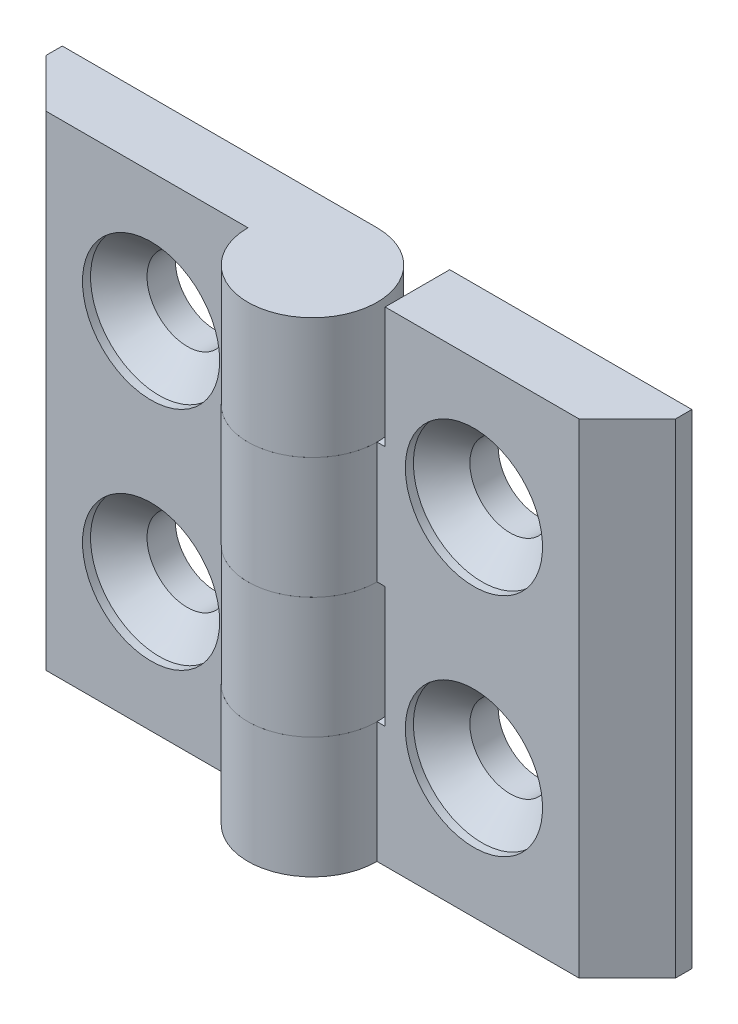
ISO-10303-21;
HEADER;
FILE_DESCRIPTION(('STEP AP214'),'2;1');
FILE_NAME('part.step','',(''),(''),'','','');
FILE_SCHEMA(('AUTOMOTIVE_DESIGN { 1 0 10303 214 1 1 1 1 }'));
ENDSEC;
DATA;
#1=APPLICATION_CONTEXT('core data for automotive mechanical design processes');
#2=APPLICATION_PROTOCOL_DEFINITION('international standard','automotive_design',2000,#1);
#3=PRODUCT_CONTEXT('',#1,'mechanical');
#4=PRODUCT('Part','Part','',(#3));
#5=PRODUCT_RELATED_PRODUCT_CATEGORY('part','',(#4));
#6=PRODUCT_DEFINITION_FORMATION('','',#4);
#7=PRODUCT_DEFINITION_CONTEXT('part definition',#1,'design');
#8=PRODUCT_DEFINITION('design','',#6,#7);
#9=PRODUCT_DEFINITION_SHAPE('','',#8);
#10=(LENGTH_UNIT() NAMED_UNIT(*) SI_UNIT(.MILLI.,.METRE.));
#11=(NAMED_UNIT(*) PLANE_ANGLE_UNIT() SI_UNIT($,.RADIAN.));
#12=(NAMED_UNIT(*) SI_UNIT($,.STERADIAN.) SOLID_ANGLE_UNIT());
#13=UNCERTAINTY_MEASURE_WITH_UNIT(LENGTH_MEASURE(1.E-05),#10,'distance_accuracy_value','');
#14=(GEOMETRIC_REPRESENTATION_CONTEXT(3) GLOBAL_UNCERTAINTY_ASSIGNED_CONTEXT((#13)) GLOBAL_UNIT_ASSIGNED_CONTEXT((#10,
#11,#12)) REPRESENTATION_CONTEXT('',''));
#15=CARTESIAN_POINT('',(0.,0.,0.));
#16=DIRECTION('',(0.,0.,1.));
#17=DIRECTION('',(1.,0.,0.));
#18=AXIS2_PLACEMENT_3D('',#15,#16,#17);
#19=CARTESIAN_POINT('',(0.,-15.,0.));
#20=DIRECTION('',(0.,1.,0.));
#21=DIRECTION('',(0.,0.,-1.));
#22=AXIS2_PLACEMENT_3D('',#19,#20,#21);
#23=CYLINDRICAL_SURFACE('',#22,4.);
#24=DIRECTION('',(0.,1.,0.));
#25=VECTOR('',#24,1.);
#26=CARTESIAN_POINT('',(4.,-15.,0.));
#27=LINE('',#26,#25);
#28=CARTESIAN_POINT('',(4.,-15.,0.));
#29=VERTEX_POINT('',#28);
#30=CARTESIAN_POINT('',(4.,-7.5,0.));
#31=VERTEX_POINT('',#30);
#32=EDGE_CURVE('E193',#29,#31,#27,.T.);
#33=ORIENTED_EDGE('',*,*,#32,.T.);
#34=CARTESIAN_POINT('',(0.,-7.5,0.));
#35=DIRECTION('',(0.,-1.,0.));
#36=DIRECTION('',(0.,0.,1.));
#37=AXIS2_PLACEMENT_3D('',#34,#35,#36);
#38=CIRCLE('',#37,4.);
#39=CARTESIAN_POINT('',(0.,-7.5,-4.));
#40=VERTEX_POINT('',#39);
#41=EDGE_CURVE('E170',#31,#40,#38,.T.);
#42=ORIENTED_EDGE('',*,*,#41,.T.);
#43=DIRECTION('',(0.,1.,0.));
#44=VECTOR('',#43,1.);
#45=CARTESIAN_POINT('',(0.,-15.,-4.));
#46=LINE('',#45,#44);
#47=CARTESIAN_POINT('',(0.,-15.,-4.));
#48=VERTEX_POINT('',#47);
#49=EDGE_CURVE('E206',#48,#40,#46,.T.);
#50=ORIENTED_EDGE('',*,*,#49,.F.);
#51=CARTESIAN_POINT('',(0.,-15.,0.));
#52=DIRECTION('',(0.,-1.,0.));
#53=DIRECTION('',(0.,0.,1.));
#54=AXIS2_PLACEMENT_3D('',#51,#52,#53);
#55=CIRCLE('',#54,4.);
#56=EDGE_CURVE('E173',#29,#48,#55,.T.);
#57=ORIENTED_EDGE('',*,*,#56,.F.);
#58=EDGE_LOOP('',(#33,#42,#50,#57));
#59=FACE_BOUND('',#58,.T.);
#60=ADVANCED_FACE('F44',(#59),#23,.T.);
#61=CARTESIAN_POINT('',(0.,0.,-4.));
#62=VERTEX_POINT('',#61);
#63=CARTESIAN_POINT('',(0.,7.5,-4.));
#64=VERTEX_POINT('',#63);
#65=EDGE_CURVE('E205',#62,#64,#46,.T.);
#66=ORIENTED_EDGE('',*,*,#65,.F.);
#67=CARTESIAN_POINT('',(0.,0.,0.));
#68=DIRECTION('',(0.,1.,0.));
#69=DIRECTION('',(0.,0.,-1.));
#70=AXIS2_PLACEMENT_3D('',#67,#68,#69);
#71=CIRCLE('',#70,4.);
#72=CARTESIAN_POINT('',(4.,0.,0.));
#73=VERTEX_POINT('',#72);
#74=EDGE_CURVE('E141',#62,#73,#71,.T.);
#75=ORIENTED_EDGE('',*,*,#74,.T.);
#76=CARTESIAN_POINT('',(4.,7.5,0.));
#77=VERTEX_POINT('',#76);
#78=EDGE_CURVE('E185',#73,#77,#27,.T.);
#79=ORIENTED_EDGE('',*,*,#78,.T.);
#80=CARTESIAN_POINT('',(0.,7.5,0.));
#81=DIRECTION('',(0.,-1.,0.));
#82=DIRECTION('',(1.,0.,0.));
#83=AXIS2_PLACEMENT_3D('',#80,#81,#82);
#84=CIRCLE('',#83,4.);
#85=EDGE_CURVE('E167',#77,#64,#84,.T.);
#86=ORIENTED_EDGE('',*,*,#85,.T.);
#87=EDGE_LOOP('',(#66,#75,#79,#86));
#88=FACE_BOUND('',#87,.T.);
#89=ADVANCED_FACE('F46',(#88),#23,.T.);
#90=CARTESIAN_POINT('',(0.,-15.,-4.));
#91=DIRECTION('',(0.,0.,1.));
#92=DIRECTION('',(-1.,0.,0.));
#93=AXIS2_PLACEMENT_3D('',#90,#91,#92);
#94=PLANE('',#93);
#95=CARTESIAN_POINT('',(9.99999999999997,-7.,-4.00000000000007));
#96=DIRECTION('',(0.,0.,1.));
#97=DIRECTION('',(-1.,0.,0.));
#98=AXIS2_PLACEMENT_3D('',#95,#96,#97);
#99=CIRCLE('',#98,2.5);
#100=CARTESIAN_POINT('',(7.49999999999997,-7.,-4.00000000000006));
#101=VERTEX_POINT('',#100);
#102=EDGE_CURVE('E376',#101,#101,#99,.T.);
#103=ORIENTED_EDGE('',*,*,#102,.T.);
#104=EDGE_LOOP('',(#103));
#105=FACE_BOUND('',#104,.T.);
#106=CARTESIAN_POINT('',(9.99999999999997,7.,-4.00000000000007));
#107=DIRECTION('',(0.,0.,1.));
#108=DIRECTION('',(-1.,0.,0.));
#109=AXIS2_PLACEMENT_3D('',#106,#107,#108);
#110=CIRCLE('',#109,2.5);
#111=CARTESIAN_POINT('',(7.49999999999997,7.,-4.00000000000006));
#112=VERTEX_POINT('',#111);
#113=EDGE_CURVE('E154',#112,#112,#110,.T.);
#114=ORIENTED_EDGE('',*,*,#113,.T.);
#115=EDGE_LOOP('',(#114));
#116=FACE_BOUND('',#115,.T.);
#117=ORIENTED_EDGE('',*,*,#49,.T.);
#118=DIRECTION('',(1.,0.,0.));
#119=VECTOR('',#118,1.);
#120=CARTESIAN_POINT('',(4.49999999999997,-7.5,-4.00000000000003));
#121=LINE('',#120,#119);
#122=CARTESIAN_POINT('',(4.49999999999997,-7.5,-4.00000000000003));
#123=VERTEX_POINT('',#122);
#124=EDGE_CURVE('E136',#40,#123,#121,.T.);
#125=ORIENTED_EDGE('',*,*,#124,.T.);
#126=DIRECTION('',(0.,1.,0.));
#127=VECTOR('',#126,1.);
#128=CARTESIAN_POINT('',(4.49999999999997,-7.5,-4.00000000000003));
#129=LINE('',#128,#127);
#130=CARTESIAN_POINT('',(4.49999999999997,0.,-4.00000000000003));
#131=VERTEX_POINT('',#130);
#132=EDGE_CURVE('E131',#123,#131,#129,.T.);
#133=ORIENTED_EDGE('',*,*,#132,.T.);
#134=DIRECTION('',(-1.,0.,0.));
#135=VECTOR('',#134,1.);
#136=CARTESIAN_POINT('',(4.49999999999997,0.,-4.00000000000003));
#137=LINE('',#136,#135);
#138=EDGE_CURVE('E139',#131,#62,#137,.T.);
#139=ORIENTED_EDGE('',*,*,#138,.T.);
#140=ORIENTED_EDGE('',*,*,#65,.T.);
#141=DIRECTION('',(1.,0.,0.));
#142=VECTOR('',#141,1.);
#143=CARTESIAN_POINT('',(-4.00000000000003,7.5,-3.99999999999997));
#144=LINE('',#143,#142);
#145=CARTESIAN_POINT('',(4.49999999999997,7.5,-4.00000000000003));
#146=VERTEX_POINT('',#145);
#147=EDGE_CURVE('E159',#64,#146,#144,.T.);
#148=ORIENTED_EDGE('',*,*,#147,.T.);
#149=DIRECTION('',(0.,1.,0.));
#150=VECTOR('',#149,1.);
#151=CARTESIAN_POINT('',(4.49999999999997,15.,-4.00000000000003));
#152=LINE('',#151,#150);
#153=CARTESIAN_POINT('',(4.49999999999997,15.,-4.00000000000003));
#154=VERTEX_POINT('',#153);
#155=EDGE_CURVE('E162',#146,#154,#152,.T.);
#156=ORIENTED_EDGE('',*,*,#155,.T.);
#157=DIRECTION('',(1.,0.,0.));
#158=VECTOR('',#157,1.);
#159=CARTESIAN_POINT('',(0.,15.,-4.));
#160=LINE('',#159,#158);
#161=CARTESIAN_POINT('',(19.5,15.,-4.00000000000014));
#162=VERTEX_POINT('',#161);
#163=EDGE_CURVE('E172',#154,#162,#160,.T.);
#164=ORIENTED_EDGE('',*,*,#163,.T.);
#165=DIRECTION('',(0.,1.,0.));
#166=VECTOR('',#165,1.);
#167=CARTESIAN_POINT('',(19.5,-15.,-4.00000000000014));
#168=LINE('',#167,#166);
#169=CARTESIAN_POINT('',(19.5,-15.,-4.00000000000014));
#170=VERTEX_POINT('',#169);
#171=EDGE_CURVE('E202',#170,#162,#168,.T.);
#172=ORIENTED_EDGE('',*,*,#171,.F.);
#173=DIRECTION('',(1.,0.,0.));
#174=VECTOR('',#173,1.);
#175=CARTESIAN_POINT('',(0.,-15.,-4.));
#176=LINE('',#175,#174);
#177=EDGE_CURVE('E176',#48,#170,#176,.T.);
#178=ORIENTED_EDGE('',*,*,#177,.F.);
#179=EDGE_LOOP('',(#117,#125,#133,#139,#140,#148,#156,#164,#172,#178));
#180=FACE_BOUND('',#179,.T.);
#181=ADVANCED_FACE('F147',(#105,#116,#180),#94,.F.);
#182=CARTESIAN_POINT('',(19.5,-15.,-4.00000000000014));
#183=DIRECTION('',(-1.,0.,0.));
#184=DIRECTION('',(0.,0.,-1.));
#185=AXIS2_PLACEMENT_3D('',#182,#183,#184);
#186=PLANE('',#185);
#187=DIRECTION('',(0.,0.,1.));
#188=VECTOR('',#187,1.);
#189=CARTESIAN_POINT('',(19.5,15.,-4.00000000000014));
#190=LINE('',#189,#188);
#191=CARTESIAN_POINT('',(19.5,15.,-3.00000000000014));
#192=VERTEX_POINT('',#191);
#193=EDGE_CURVE('E187',#162,#192,#190,.T.);
#194=ORIENTED_EDGE('',*,*,#193,.T.);
#195=DIRECTION('',(0.,1.,0.));
#196=VECTOR('',#195,1.);
#197=CARTESIAN_POINT('',(19.5,-15.,-3.00000000000014));
#198=LINE('',#197,#196);
#199=CARTESIAN_POINT('',(19.5,-15.,-3.00000000000014));
#200=VERTEX_POINT('',#199);
#201=EDGE_CURVE('E199',#200,#192,#198,.T.);
#202=ORIENTED_EDGE('',*,*,#201,.F.);
#203=DIRECTION('',(0.,0.,1.));
#204=VECTOR('',#203,1.);
#205=CARTESIAN_POINT('',(19.5,-15.,-4.00000000000014));
#206=LINE('',#205,#204);
#207=EDGE_CURVE('E179',#170,#200,#206,.T.);
#208=ORIENTED_EDGE('',*,*,#207,.F.);
#209=ORIENTED_EDGE('',*,*,#171,.T.);
#210=EDGE_LOOP('',(#194,#202,#208,#209));
#211=FACE_BOUND('',#210,.T.);
#212=ADVANCED_FACE('F236',(#211),#186,.F.);
#213=CARTESIAN_POINT('',(19.5,-15.,-3.00000000000014));
#214=DIRECTION('',(-0.707106781186549,0.,-0.707106781186546));
#215=DIRECTION('',(0.707106781186546,0.,-0.707106781186549));
#216=AXIS2_PLACEMENT_3D('',#213,#214,#215);
#217=PLANE('',#216);
#218=DIRECTION('',(-0.707106781186546,0.,0.707106781186549));
#219=VECTOR('',#218,1.);
#220=CARTESIAN_POINT('',(19.5,15.,-3.00000000000014));
#221=LINE('',#220,#219);
#222=CARTESIAN_POINT('',(16.5,15.,-1.23301553056196E-13));
#223=VERTEX_POINT('',#222);
#224=EDGE_CURVE('E189',#192,#223,#221,.T.);
#225=ORIENTED_EDGE('',*,*,#224,.T.);
#226=DIRECTION('',(0.,1.,0.));
#227=VECTOR('',#226,1.);
#228=CARTESIAN_POINT('',(16.5,-15.,-1.23301553056196E-13));
#229=LINE('',#228,#227);
#230=CARTESIAN_POINT('',(16.5,-15.,-1.23301553056196E-13));
#231=VERTEX_POINT('',#230);
#232=EDGE_CURVE('E196',#231,#223,#229,.T.);
#233=ORIENTED_EDGE('',*,*,#232,.F.);
#234=DIRECTION('',(-0.707106781186546,0.,0.707106781186549));
#235=VECTOR('',#234,1.);
#236=CARTESIAN_POINT('',(19.5,-15.,-3.00000000000014));
#237=LINE('',#236,#235);
#238=EDGE_CURVE('E181',#200,#231,#237,.T.);
#239=ORIENTED_EDGE('',*,*,#238,.F.);
#240=ORIENTED_EDGE('',*,*,#201,.T.);
#241=EDGE_LOOP('',(#225,#233,#239,#240));
#242=FACE_BOUND('',#241,.T.);
#243=ADVANCED_FACE('F233',(#242),#217,.F.);
#244=CARTESIAN_POINT('',(16.5,-15.,-1.23301553056196E-13));
#245=DIRECTION('',(0.,0.,-1.));
#246=DIRECTION('',(1.,0.,0.));
#247=AXIS2_PLACEMENT_3D('',#244,#245,#246);
#248=PLANE('',#247);
#249=CARTESIAN_POINT('',(10.,-7.,0.));
#250=DIRECTION('',(0.,0.,1.));
#251=DIRECTION('',(-1.,0.,0.));
#252=AXIS2_PLACEMENT_3D('',#249,#250,#251);
#253=CIRCLE('',#252,4.25);
#254=CARTESIAN_POINT('',(5.75,-7.,0.));
#255=VERTEX_POINT('',#254);
#256=EDGE_CURVE('E369',#255,#255,#253,.T.);
#257=ORIENTED_EDGE('',*,*,#256,.F.);
#258=EDGE_LOOP('',(#257));
#259=FACE_BOUND('',#258,.T.);
#260=CARTESIAN_POINT('',(10.,7.,0.));
#261=DIRECTION('',(0.,0.,1.));
#262=DIRECTION('',(-1.,0.,0.));
#263=AXIS2_PLACEMENT_3D('',#260,#261,#262);
#264=CIRCLE('',#263,4.25);
#265=CARTESIAN_POINT('',(5.75,7.,0.));
#266=VERTEX_POINT('',#265);
#267=EDGE_CURVE('E378',#266,#266,#264,.T.);
#268=ORIENTED_EDGE('',*,*,#267,.F.);
#269=EDGE_LOOP('',(#268));
#270=FACE_BOUND('',#269,.T.);
#271=DIRECTION('',(0.,-1.,0.));
#272=VECTOR('',#271,1.);
#273=CARTESIAN_POINT('',(4.5,-15.,0.));
#274=LINE('',#273,#272);
#275=CARTESIAN_POINT('',(4.5,0.,0.));
#276=VERTEX_POINT('',#275);
#277=CARTESIAN_POINT('',(4.5,-7.5,0.));
#278=VERTEX_POINT('',#277);
#279=EDGE_CURVE('E52',#276,#278,#274,.T.);
#280=ORIENTED_EDGE('',*,*,#279,.T.);
#281=DIRECTION('',(-1.,0.,0.));
#282=VECTOR('',#281,1.);
#283=CARTESIAN_POINT('',(16.5,-7.5,-1.23301553056196E-13));
#284=LINE('',#283,#282);
#285=EDGE_CURVE('E12',#278,#31,#284,.T.);
#286=ORIENTED_EDGE('',*,*,#285,.T.);
#287=ORIENTED_EDGE('',*,*,#32,.F.);
#288=DIRECTION('',(-1.,0.,0.));
#289=VECTOR('',#288,1.);
#290=CARTESIAN_POINT('',(16.5,-15.,-1.23301553056196E-13));
#291=LINE('',#290,#289);
#292=EDGE_CURVE('E183',#231,#29,#291,.T.);
#293=ORIENTED_EDGE('',*,*,#292,.F.);
#294=ORIENTED_EDGE('',*,*,#232,.T.);
#295=DIRECTION('',(-1.,0.,0.));
#296=VECTOR('',#295,1.);
#297=CARTESIAN_POINT('',(16.5,15.,-1.23301553056196E-13));
#298=LINE('',#297,#296);
#299=CARTESIAN_POINT('',(4.5,15.,0.));
#300=VERTEX_POINT('',#299);
#301=EDGE_CURVE('E177',#223,#300,#298,.T.);
#302=ORIENTED_EDGE('',*,*,#301,.T.);
#303=DIRECTION('',(0.,-1.,0.));
#304=VECTOR('',#303,1.);
#305=CARTESIAN_POINT('',(4.49999999999999,-15.,0.));
#306=LINE('',#305,#304);
#307=CARTESIAN_POINT('',(4.5,7.5,0.));
#308=VERTEX_POINT('',#307);
#309=EDGE_CURVE('E67',#300,#308,#306,.T.);
#310=ORIENTED_EDGE('',*,*,#309,.T.);
#311=DIRECTION('',(-1.,0.,0.));
#312=VECTOR('',#311,1.);
#313=CARTESIAN_POINT('',(16.5,7.5,-1.23301553056196E-13));
#314=LINE('',#313,#312);
#315=EDGE_CURVE('E208',#308,#77,#314,.T.);
#316=ORIENTED_EDGE('',*,*,#315,.T.);
#317=ORIENTED_EDGE('',*,*,#78,.F.);
#318=DIRECTION('',(1.,0.,0.));
#319=VECTOR('',#318,1.);
#320=CARTESIAN_POINT('',(16.5,0.,-1.23301553056196E-13));
#321=LINE('',#320,#319);
#322=EDGE_CURVE('E211',#73,#276,#321,.T.);
#323=ORIENTED_EDGE('',*,*,#322,.T.);
#324=EDGE_LOOP('',(#280,#286,#287,#293,#294,#302,#310,#316,#317,#323));
#325=FACE_BOUND('',#324,.T.);
#326=ADVANCED_FACE('F213',(#259,#270,#325),#248,.F.);
#327=CARTESIAN_POINT('',(0.,-15.,0.));
#328=DIRECTION('',(0.,-1.,0.));
#329=DIRECTION('',(0.,0.,1.));
#330=AXIS2_PLACEMENT_3D('',#327,#328,#329);
#331=PLANE('',#330);
#332=ORIENTED_EDGE('',*,*,#56,.T.);
#333=ORIENTED_EDGE('',*,*,#177,.T.);
#334=ORIENTED_EDGE('',*,*,#207,.T.);
#335=ORIENTED_EDGE('',*,*,#238,.T.);
#336=ORIENTED_EDGE('',*,*,#292,.T.);
#337=EDGE_LOOP('',(#332,#333,#334,#335,#336));
#338=FACE_BOUND('',#337,.T.);
#339=ADVANCED_FACE('F242',(#338),#331,.T.);
#340=CARTESIAN_POINT('',(0.,15.,0.));
#341=DIRECTION('',(0.,-1.,0.));
#342=DIRECTION('',(0.,0.,1.));
#343=AXIS2_PLACEMENT_3D('',#340,#341,#342);
#344=PLANE('',#343);
#345=ORIENTED_EDGE('',*,*,#163,.F.);
#346=DIRECTION('',(0.,0.,1.));
#347=VECTOR('',#346,1.);
#348=CARTESIAN_POINT('',(4.49999999999997,15.,-4.00000000000003));
#349=LINE('',#348,#347);
#350=EDGE_CURVE('E149',#154,#300,#349,.T.);
#351=ORIENTED_EDGE('',*,*,#350,.T.);
#352=ORIENTED_EDGE('',*,*,#301,.F.);
#353=ORIENTED_EDGE('',*,*,#224,.F.);
#354=ORIENTED_EDGE('',*,*,#193,.F.);
#355=EDGE_LOOP('',(#345,#351,#352,#353,#354));
#356=FACE_BOUND('',#355,.T.);
#357=ADVANCED_FACE('F226',(#356),#344,.F.);
#358=CARTESIAN_POINT('',(-4.00000000000003,7.5,-3.99999999999997));
#359=DIRECTION('',(0.,-1.,0.));
#360=DIRECTION('',(1.,0.,0.));
#361=AXIS2_PLACEMENT_3D('',#358,#359,#360);
#362=PLANE('',#361);
#363=ORIENTED_EDGE('',*,*,#85,.F.);
#364=ORIENTED_EDGE('',*,*,#315,.F.);
#365=DIRECTION('',(0.,0.,1.));
#366=VECTOR('',#365,1.);
#367=CARTESIAN_POINT('',(4.49999999999997,7.5,-4.00000000000003));
#368=LINE('',#367,#366);
#369=EDGE_CURVE('E151',#146,#308,#368,.T.);
#370=ORIENTED_EDGE('',*,*,#369,.F.);
#371=ORIENTED_EDGE('',*,*,#147,.F.);
#372=EDGE_LOOP('',(#363,#364,#370,#371));
#373=FACE_BOUND('',#372,.T.);
#374=ADVANCED_FACE('F222',(#373),#362,.F.);
#375=CARTESIAN_POINT('',(4.49999999999997,15.,-4.00000000000003));
#376=DIRECTION('',(1.,0.,0.));
#377=DIRECTION('',(0.,1.,0.));
#378=AXIS2_PLACEMENT_3D('',#375,#376,#377);
#379=PLANE('',#378);
#380=ORIENTED_EDGE('',*,*,#350,.F.);
#381=ORIENTED_EDGE('',*,*,#155,.F.);
#382=ORIENTED_EDGE('',*,*,#369,.T.);
#383=ORIENTED_EDGE('',*,*,#309,.F.);
#384=EDGE_LOOP('',(#380,#381,#382,#383));
#385=FACE_BOUND('',#384,.T.);
#386=ADVANCED_FACE('F223',(#385),#379,.F.);
#387=CARTESIAN_POINT('',(4.49999999999997,-7.5,-4.00000000000003));
#388=DIRECTION('',(1.,0.,0.));
#389=DIRECTION('',(0.,1.,0.));
#390=AXIS2_PLACEMENT_3D('',#387,#388,#389);
#391=PLANE('',#390);
#392=DIRECTION('',(0.,0.,1.));
#393=VECTOR('',#392,1.);
#394=CARTESIAN_POINT('',(4.49999999999997,0.,-4.00000000000003));
#395=LINE('',#394,#393);
#396=EDGE_CURVE('E59',#131,#276,#395,.T.);
#397=ORIENTED_EDGE('',*,*,#396,.F.);
#398=ORIENTED_EDGE('',*,*,#132,.F.);
#399=DIRECTION('',(0.,0.,1.));
#400=VECTOR('',#399,1.);
#401=CARTESIAN_POINT('',(4.49999999999997,-7.5,-4.00000000000003));
#402=LINE('',#401,#400);
#403=EDGE_CURVE('E135',#123,#278,#402,.T.);
#404=ORIENTED_EDGE('',*,*,#403,.T.);
#405=ORIENTED_EDGE('',*,*,#279,.F.);
#406=EDGE_LOOP('',(#397,#398,#404,#405));
#407=FACE_BOUND('',#406,.T.);
#408=ADVANCED_FACE('F128',(#407),#391,.F.);
#409=CARTESIAN_POINT('',(4.49999999999997,-7.5,-4.00000000000003));
#410=DIRECTION('',(0.,-1.,0.));
#411=DIRECTION('',(0.,0.,1.));
#412=AXIS2_PLACEMENT_3D('',#409,#410,#411);
#413=PLANE('',#412);
#414=ORIENTED_EDGE('',*,*,#41,.F.);
#415=ORIENTED_EDGE('',*,*,#285,.F.);
#416=ORIENTED_EDGE('',*,*,#403,.F.);
#417=ORIENTED_EDGE('',*,*,#124,.F.);
#418=EDGE_LOOP('',(#414,#415,#416,#417));
#419=FACE_BOUND('',#418,.T.);
#420=ADVANCED_FACE('F245',(#419),#413,.F.);
#421=CARTESIAN_POINT('',(4.49999999999997,0.,-4.00000000000003));
#422=DIRECTION('',(0.,1.,0.));
#423=DIRECTION('',(0.,0.,-1.));
#424=AXIS2_PLACEMENT_3D('',#421,#422,#423);
#425=PLANE('',#424);
#426=ORIENTED_EDGE('',*,*,#138,.F.);
#427=ORIENTED_EDGE('',*,*,#396,.T.);
#428=ORIENTED_EDGE('',*,*,#322,.F.);
#429=ORIENTED_EDGE('',*,*,#74,.F.);
#430=EDGE_LOOP('',(#426,#427,#428,#429));
#431=FACE_BOUND('',#430,.T.);
#432=ADVANCED_FACE('F140',(#431),#425,.F.);
#433=CARTESIAN_POINT('',(10.,7.,0.));
#434=DIRECTION('',(0.,0.,1.));
#435=DIRECTION('',(-1.,0.,0.));
#436=AXIS2_PLACEMENT_3D('',#433,#434,#435);
#437=CYLINDRICAL_SURFACE('',#436,2.5);
#438=ORIENTED_EDGE('',*,*,#113,.F.);
#439=EDGE_LOOP('',(#438));
#440=FACE_BOUND('',#439,.T.);
#441=CARTESIAN_POINT('',(9.99999999999998,7.,-2.25000000000007));
#442=DIRECTION('',(0.,0.,1.));
#443=DIRECTION('',(-1.,0.,0.));
#444=AXIS2_PLACEMENT_3D('',#441,#442,#443);
#445=CIRCLE('',#444,2.5);
#446=CARTESIAN_POINT('',(7.49999999999998,7.,-2.25000000000005));
#447=VERTEX_POINT('',#446);
#448=EDGE_CURVE('E383',#447,#447,#445,.T.);
#449=ORIENTED_EDGE('',*,*,#448,.T.);
#450=EDGE_LOOP('',(#449));
#451=FACE_BOUND('',#450,.T.);
#452=ADVANCED_FACE('F252',(#440,#451),#437,.F.);
#453=CARTESIAN_POINT('',(9.99999999999999,7.,-0.500000000000075));
#454=DIRECTION('',(0.,0.,1.));
#455=DIRECTION('',(-1.,0.,0.));
#456=AXIS2_PLACEMENT_3D('',#453,#454,#455);
#457=CONICAL_SURFACE('',#456,4.25,0.785398163397449);
#458=ORIENTED_EDGE('',*,*,#448,.F.);
#459=EDGE_LOOP('',(#458));
#460=FACE_BOUND('',#459,.T.);
#461=CARTESIAN_POINT('',(9.99999999999999,7.,-0.500000000000075));
#462=DIRECTION('',(0.,0.,1.));
#463=DIRECTION('',(-1.,0.,0.));
#464=AXIS2_PLACEMENT_3D('',#461,#462,#463);
#465=CIRCLE('',#464,4.25);
#466=CARTESIAN_POINT('',(5.74999999999999,7.,-0.500000000000043));
#467=VERTEX_POINT('',#466);
#468=EDGE_CURVE('E381',#467,#467,#465,.T.);
#469=ORIENTED_EDGE('',*,*,#468,.T.);
#470=EDGE_LOOP('',(#469));
#471=FACE_BOUND('',#470,.T.);
#472=ADVANCED_FACE('F310',(#460,#471),#457,.F.);
#473=CARTESIAN_POINT('',(10.,7.,0.));
#474=DIRECTION('',(0.,0.,1.));
#475=DIRECTION('',(-1.,0.,0.));
#476=AXIS2_PLACEMENT_3D('',#473,#474,#475);
#477=CYLINDRICAL_SURFACE('',#476,4.25);
#478=ORIENTED_EDGE('',*,*,#468,.F.);
#479=EDGE_LOOP('',(#478));
#480=FACE_BOUND('',#479,.T.);
#481=ORIENTED_EDGE('',*,*,#267,.T.);
#482=EDGE_LOOP('',(#481));
#483=FACE_BOUND('',#482,.T.);
#484=ADVANCED_FACE('F319',(#480,#483),#477,.F.);
#485=CARTESIAN_POINT('',(10.,-7.,0.));
#486=DIRECTION('',(0.,0.,1.));
#487=DIRECTION('',(-1.,0.,0.));
#488=AXIS2_PLACEMENT_3D('',#485,#486,#487);
#489=CYLINDRICAL_SURFACE('',#488,2.5);
#490=ORIENTED_EDGE('',*,*,#102,.F.);
#491=EDGE_LOOP('',(#490));
#492=FACE_BOUND('',#491,.T.);
#493=CARTESIAN_POINT('',(9.99999999999998,-7.,-2.25000000000007));
#494=DIRECTION('',(0.,0.,1.));
#495=DIRECTION('',(-1.,0.,0.));
#496=AXIS2_PLACEMENT_3D('',#493,#494,#495);
#497=CIRCLE('',#496,2.5);
#498=CARTESIAN_POINT('',(7.49999999999998,-7.,-2.25000000000005));
#499=VERTEX_POINT('',#498);
#500=EDGE_CURVE('E371',#499,#499,#497,.T.);
#501=ORIENTED_EDGE('',*,*,#500,.T.);
#502=EDGE_LOOP('',(#501));
#503=FACE_BOUND('',#502,.T.);
#504=ADVANCED_FACE('F329',(#492,#503),#489,.F.);
#505=CARTESIAN_POINT('',(9.99999999999999,-7.,-0.500000000000075));
#506=DIRECTION('',(0.,0.,1.));
#507=DIRECTION('',(-1.,0.,0.));
#508=AXIS2_PLACEMENT_3D('',#505,#506,#507);
#509=CONICAL_SURFACE('',#508,4.25,0.785398163397449);
#510=ORIENTED_EDGE('',*,*,#500,.F.);
#511=EDGE_LOOP('',(#510));
#512=FACE_BOUND('',#511,.T.);
#513=CARTESIAN_POINT('',(9.99999999999999,-7.,-0.500000000000075));
#514=DIRECTION('',(0.,0.,1.));
#515=DIRECTION('',(-1.,0.,0.));
#516=AXIS2_PLACEMENT_3D('',#513,#514,#515);
#517=CIRCLE('',#516,4.25);
#518=CARTESIAN_POINT('',(5.74999999999999,-7.,-0.500000000000043));
#519=VERTEX_POINT('',#518);
#520=EDGE_CURVE('E366',#519,#519,#517,.T.);
#521=ORIENTED_EDGE('',*,*,#520,.T.);
#522=EDGE_LOOP('',(#521));
#523=FACE_BOUND('',#522,.T.);
#524=ADVANCED_FACE('F339',(#512,#523),#509,.F.);
#525=CARTESIAN_POINT('',(10.,-7.,0.));
#526=DIRECTION('',(0.,0.,1.));
#527=DIRECTION('',(-1.,0.,0.));
#528=AXIS2_PLACEMENT_3D('',#525,#526,#527);
#529=CYLINDRICAL_SURFACE('',#528,4.25);
#530=ORIENTED_EDGE('',*,*,#520,.F.);
#531=EDGE_LOOP('',(#530));
#532=FACE_BOUND('',#531,.T.);
#533=ORIENTED_EDGE('',*,*,#256,.T.);
#534=EDGE_LOOP('',(#533));
#535=FACE_BOUND('',#534,.T.);
#536=ADVANCED_FACE('F349',(#532,#535),#529,.F.);
#537=CLOSED_SHELL('',(#60,#89,#181,#212,#243,#326,#339,#357,#374,#386,#408,#420,#432,#452,#472,
#484,#504,#524,#536));
#538=MANIFOLD_SOLID_BREP('B2',#537);
#539=CARTESIAN_POINT('',(0.,15.,0.));
#540=DIRECTION('',(0.,-1.,0.));
#541=DIRECTION('',(0.,0.,-1.));
#542=AXIS2_PLACEMENT_3D('',#539,#540,#541);
#543=CYLINDRICAL_SURFACE('',#542,4.);
#544=DIRECTION('',(0.,-1.,0.));
#545=VECTOR('',#544,1.);
#546=CARTESIAN_POINT('',(-4.,15.,0.));
#547=LINE('',#546,#545);
#548=CARTESIAN_POINT('',(-4.,15.,0.));
#549=VERTEX_POINT('',#548);
#550=CARTESIAN_POINT('',(-4.,7.5,0.));
#551=VERTEX_POINT('',#550);
#552=EDGE_CURVE('E597',#549,#551,#547,.T.);
#553=ORIENTED_EDGE('',*,*,#552,.T.);
#554=CARTESIAN_POINT('',(0.,7.5,0.));
#555=DIRECTION('',(0.,1.,0.));
#556=DIRECTION('',(0.,0.,1.));
#557=AXIS2_PLACEMENT_3D('',#554,#555,#556);
#558=CIRCLE('',#557,4.);
#559=CARTESIAN_POINT('',(0.,7.5,-4.));
#560=VERTEX_POINT('',#559);
#561=EDGE_CURVE('E574',#551,#560,#558,.T.);
#562=ORIENTED_EDGE('',*,*,#561,.T.);
#563=DIRECTION('',(0.,-1.,0.));
#564=VECTOR('',#563,1.);
#565=CARTESIAN_POINT('',(0.,15.,-4.));
#566=LINE('',#565,#564);
#567=CARTESIAN_POINT('',(0.,15.,-4.));
#568=VERTEX_POINT('',#567);
#569=EDGE_CURVE('E610',#568,#560,#566,.T.);
#570=ORIENTED_EDGE('',*,*,#569,.F.);
#571=CARTESIAN_POINT('',(0.,15.,0.));
#572=DIRECTION('',(0.,1.,0.));
#573=DIRECTION('',(0.,0.,1.));
#574=AXIS2_PLACEMENT_3D('',#571,#572,#573);
#575=CIRCLE('',#574,4.);
#576=EDGE_CURVE('E577',#549,#568,#575,.T.);
#577=ORIENTED_EDGE('',*,*,#576,.F.);
#578=EDGE_LOOP('',(#553,#562,#570,#577));
#579=FACE_BOUND('',#578,.T.);
#580=ADVANCED_FACE('F448',(#579),#543,.T.);
#581=CARTESIAN_POINT('',(0.,0.,-4.));
#582=VERTEX_POINT('',#581);
#583=CARTESIAN_POINT('',(0.,-7.5,-4.));
#584=VERTEX_POINT('',#583);
#585=EDGE_CURVE('E609',#582,#584,#566,.T.);
#586=ORIENTED_EDGE('',*,*,#585,.F.);
#587=CARTESIAN_POINT('',(0.,0.,0.));
#588=DIRECTION('',(0.,-1.,0.));
#589=DIRECTION('',(0.,0.,-1.));
#590=AXIS2_PLACEMENT_3D('',#587,#588,#589);
#591=CIRCLE('',#590,4.);
#592=CARTESIAN_POINT('',(-4.,0.,0.));
#593=VERTEX_POINT('',#592);
#594=EDGE_CURVE('E545',#582,#593,#591,.T.);
#595=ORIENTED_EDGE('',*,*,#594,.T.);
#596=CARTESIAN_POINT('',(-4.,-7.5,0.));
#597=VERTEX_POINT('',#596);
#598=EDGE_CURVE('E589',#593,#597,#547,.T.);
#599=ORIENTED_EDGE('',*,*,#598,.T.);
#600=CARTESIAN_POINT('',(0.,-7.5,0.));
#601=DIRECTION('',(0.,1.,0.));
#602=DIRECTION('',(-1.,0.,0.));
#603=AXIS2_PLACEMENT_3D('',#600,#601,#602);
#604=CIRCLE('',#603,4.);
#605=EDGE_CURVE('E571',#597,#584,#604,.T.);
#606=ORIENTED_EDGE('',*,*,#605,.T.);
#607=EDGE_LOOP('',(#586,#595,#599,#606));
#608=FACE_BOUND('',#607,.T.);
#609=ADVANCED_FACE('F450',(#608),#543,.T.);
#610=CARTESIAN_POINT('',(0.,15.,-4.));
#611=DIRECTION('',(0.,0.,1.));
#612=DIRECTION('',(1.,0.,0.));
#613=AXIS2_PLACEMENT_3D('',#610,#611,#612);
#614=PLANE('',#613);
#615=CARTESIAN_POINT('',(-10.,7.,-4.));
#616=DIRECTION('',(0.,0.,1.));
#617=DIRECTION('',(1.,0.,0.));
#618=AXIS2_PLACEMENT_3D('',#615,#616,#617);
#619=CIRCLE('',#618,2.5);
#620=CARTESIAN_POINT('',(-7.5,7.,-4.));
#621=VERTEX_POINT('',#620);
#622=EDGE_CURVE('E794',#621,#621,#619,.T.);
#623=ORIENTED_EDGE('',*,*,#622,.T.);
#624=EDGE_LOOP('',(#623));
#625=FACE_BOUND('',#624,.T.);
#626=CARTESIAN_POINT('',(-10.,-7.,-4.));
#627=DIRECTION('',(0.,0.,1.));
#628=DIRECTION('',(1.,0.,0.));
#629=AXIS2_PLACEMENT_3D('',#626,#627,#628);
#630=CIRCLE('',#629,2.5);
#631=CARTESIAN_POINT('',(-7.5,-7.,-4.));
#632=VERTEX_POINT('',#631);
#633=EDGE_CURVE('E558',#632,#632,#630,.T.);
#634=ORIENTED_EDGE('',*,*,#633,.T.);
#635=EDGE_LOOP('',(#634));
#636=FACE_BOUND('',#635,.T.);
#637=ORIENTED_EDGE('',*,*,#569,.T.);
#638=DIRECTION('',(-1.,0.,0.));
#639=VECTOR('',#638,1.);
#640=CARTESIAN_POINT('',(-4.5,7.5,-4.));
#641=LINE('',#640,#639);
#642=CARTESIAN_POINT('',(-4.5,7.5,-4.));
#643=VERTEX_POINT('',#642);
#644=EDGE_CURVE('E540',#560,#643,#641,.T.);
#645=ORIENTED_EDGE('',*,*,#644,.T.);
#646=DIRECTION('',(0.,-1.,0.));
#647=VECTOR('',#646,1.);
#648=CARTESIAN_POINT('',(-4.5,7.5,-4.));
#649=LINE('',#648,#647);
#650=CARTESIAN_POINT('',(-4.5,0.,-4.));
#651=VERTEX_POINT('',#650);
#652=EDGE_CURVE('E535',#643,#651,#649,.T.);
#653=ORIENTED_EDGE('',*,*,#652,.T.);
#654=DIRECTION('',(1.,0.,0.));
#655=VECTOR('',#654,1.);
#656=CARTESIAN_POINT('',(-4.5,0.,-4.));
#657=LINE('',#656,#655);
#658=EDGE_CURVE('E543',#651,#582,#657,.T.);
#659=ORIENTED_EDGE('',*,*,#658,.T.);
#660=ORIENTED_EDGE('',*,*,#585,.T.);
#661=DIRECTION('',(-1.,0.,0.));
#662=VECTOR('',#661,1.);
#663=CARTESIAN_POINT('',(4.,-7.5,-4.));
#664=LINE('',#663,#662);
#665=CARTESIAN_POINT('',(-4.5,-7.5,-4.));
#666=VERTEX_POINT('',#665);
#667=EDGE_CURVE('E563',#584,#666,#664,.T.);
#668=ORIENTED_EDGE('',*,*,#667,.T.);
#669=DIRECTION('',(0.,-1.,0.));
#670=VECTOR('',#669,1.);
#671=CARTESIAN_POINT('',(-4.5,-15.,-4.));
#672=LINE('',#671,#670);
#673=CARTESIAN_POINT('',(-4.5,-15.,-4.));
#674=VERTEX_POINT('',#673);
#675=EDGE_CURVE('E566',#666,#674,#672,.T.);
#676=ORIENTED_EDGE('',*,*,#675,.T.);
#677=DIRECTION('',(-1.,0.,0.));
#678=VECTOR('',#677,1.);
#679=CARTESIAN_POINT('',(0.,-15.,-4.));
#680=LINE('',#679,#678);
#681=CARTESIAN_POINT('',(-19.5,-15.,-4.));
#682=VERTEX_POINT('',#681);
#683=EDGE_CURVE('E576',#674,#682,#680,.T.);
#684=ORIENTED_EDGE('',*,*,#683,.T.);
#685=DIRECTION('',(0.,-1.,0.));
#686=VECTOR('',#685,1.);
#687=CARTESIAN_POINT('',(-19.5,15.,-4.));
#688=LINE('',#687,#686);
#689=CARTESIAN_POINT('',(-19.5,15.,-4.));
#690=VERTEX_POINT('',#689);
#691=EDGE_CURVE('E606',#690,#682,#688,.T.);
#692=ORIENTED_EDGE('',*,*,#691,.F.);
#693=DIRECTION('',(-1.,0.,0.));
#694=VECTOR('',#693,1.);
#695=CARTESIAN_POINT('',(0.,15.,-4.));
#696=LINE('',#695,#694);
#697=EDGE_CURVE('E580',#568,#690,#696,.T.);
#698=ORIENTED_EDGE('',*,*,#697,.F.);
#699=EDGE_LOOP('',(#637,#645,#653,#659,#660,#668,#676,#684,#692,#698));
#700=FACE_BOUND('',#699,.T.);
#701=ADVANCED_FACE('F551',(#625,#636,#700),#614,.F.);
#702=CARTESIAN_POINT('',(-19.5,15.,-4.));
#703=DIRECTION('',(1.,0.,0.));
#704=DIRECTION('',(0.,0.,-1.));
#705=AXIS2_PLACEMENT_3D('',#702,#703,#704);
#706=PLANE('',#705);
#707=DIRECTION('',(0.,0.,1.));
#708=VECTOR('',#707,1.);
#709=CARTESIAN_POINT('',(-19.5,-15.,-4.));
#710=LINE('',#709,#708);
#711=CARTESIAN_POINT('',(-19.5,-15.,-3.));
#712=VERTEX_POINT('',#711);
#713=EDGE_CURVE('E591',#682,#712,#710,.T.);
#714=ORIENTED_EDGE('',*,*,#713,.T.);
#715=DIRECTION('',(0.,-1.,0.));
#716=VECTOR('',#715,1.);
#717=CARTESIAN_POINT('',(-19.5,15.,-3.));
#718=LINE('',#717,#716);
#719=CARTESIAN_POINT('',(-19.5,15.,-3.));
#720=VERTEX_POINT('',#719);
#721=EDGE_CURVE('E603',#720,#712,#718,.T.);
#722=ORIENTED_EDGE('',*,*,#721,.F.);
#723=DIRECTION('',(0.,0.,1.));
#724=VECTOR('',#723,1.);
#725=CARTESIAN_POINT('',(-19.5,15.,-4.));
#726=LINE('',#725,#724);
#727=EDGE_CURVE('E583',#690,#720,#726,.T.);
#728=ORIENTED_EDGE('',*,*,#727,.F.);
#729=ORIENTED_EDGE('',*,*,#691,.T.);
#730=EDGE_LOOP('',(#714,#722,#728,#729));
#731=FACE_BOUND('',#730,.T.);
#732=ADVANCED_FACE('F640',(#731),#706,.F.);
#733=CARTESIAN_POINT('',(-19.5,15.,-3.));
#734=DIRECTION('',(0.707106781186544,0.,-0.707106781186551));
#735=DIRECTION('',(-0.707106781186551,0.,-0.707106781186544));
#736=AXIS2_PLACEMENT_3D('',#733,#734,#735);
#737=PLANE('',#736);
#738=DIRECTION('',(0.707106781186551,0.,0.707106781186544));
#739=VECTOR('',#738,1.);
#740=CARTESIAN_POINT('',(-19.5,-15.,-3.));
#741=LINE('',#740,#739);
#742=CARTESIAN_POINT('',(-16.5,-15.,0.));
#743=VERTEX_POINT('',#742);
#744=EDGE_CURVE('E593',#712,#743,#741,.T.);
#745=ORIENTED_EDGE('',*,*,#744,.T.);
#746=DIRECTION('',(0.,-1.,0.));
#747=VECTOR('',#746,1.);
#748=CARTESIAN_POINT('',(-16.5,15.,0.));
#749=LINE('',#748,#747);
#750=CARTESIAN_POINT('',(-16.5,15.,0.));
#751=VERTEX_POINT('',#750);
#752=EDGE_CURVE('E600',#751,#743,#749,.T.);
#753=ORIENTED_EDGE('',*,*,#752,.F.);
#754=DIRECTION('',(0.707106781186551,0.,0.707106781186544));
#755=VECTOR('',#754,1.);
#756=CARTESIAN_POINT('',(-19.5,15.,-3.));
#757=LINE('',#756,#755);
#758=EDGE_CURVE('E585',#720,#751,#757,.T.);
#759=ORIENTED_EDGE('',*,*,#758,.F.);
#760=ORIENTED_EDGE('',*,*,#721,.T.);
#761=EDGE_LOOP('',(#745,#753,#759,#760));
#762=FACE_BOUND('',#761,.T.);
#763=ADVANCED_FACE('F637',(#762),#737,.F.);
#764=CARTESIAN_POINT('',(-16.5,15.,0.));
#765=DIRECTION('',(0.,0.,-1.));
#766=DIRECTION('',(-1.,0.,0.));
#767=AXIS2_PLACEMENT_3D('',#764,#765,#766);
#768=PLANE('',#767);
#769=CARTESIAN_POINT('',(-10.,7.,0.));
#770=DIRECTION('',(0.,0.,1.));
#771=DIRECTION('',(1.,0.,0.));
#772=AXIS2_PLACEMENT_3D('',#769,#770,#771);
#773=CIRCLE('',#772,4.25);
#774=CARTESIAN_POINT('',(-5.75,7.,0.));
#775=VERTEX_POINT('',#774);
#776=EDGE_CURVE('E787',#775,#775,#773,.T.);
#777=ORIENTED_EDGE('',*,*,#776,.F.);
#778=EDGE_LOOP('',(#777));
#779=FACE_BOUND('',#778,.T.);
#780=CARTESIAN_POINT('',(-10.,-7.,0.));
#781=DIRECTION('',(0.,0.,1.));
#782=DIRECTION('',(1.,0.,0.));
#783=AXIS2_PLACEMENT_3D('',#780,#781,#782);
#784=CIRCLE('',#783,4.25);
#785=CARTESIAN_POINT('',(-5.75,-7.,0.));
#786=VERTEX_POINT('',#785);
#787=EDGE_CURVE('E796',#786,#786,#784,.T.);
#788=ORIENTED_EDGE('',*,*,#787,.F.);
#789=EDGE_LOOP('',(#788));
#790=FACE_BOUND('',#789,.T.);
#791=DIRECTION('',(0.,1.,0.));
#792=VECTOR('',#791,1.);
#793=CARTESIAN_POINT('',(-4.5,15.,0.));
#794=LINE('',#793,#792);
#795=CARTESIAN_POINT('',(-4.5,0.,0.));
#796=VERTEX_POINT('',#795);
#797=CARTESIAN_POINT('',(-4.5,7.5,0.));
#798=VERTEX_POINT('',#797);
#799=EDGE_CURVE('E456',#796,#798,#794,.T.);
#800=ORIENTED_EDGE('',*,*,#799,.T.);
#801=DIRECTION('',(1.,0.,0.));
#802=VECTOR('',#801,1.);
#803=CARTESIAN_POINT('',(-16.5,7.5,0.));
#804=LINE('',#803,#802);
#805=EDGE_CURVE('E42',#798,#551,#804,.T.);
#806=ORIENTED_EDGE('',*,*,#805,.T.);
#807=ORIENTED_EDGE('',*,*,#552,.F.);
#808=DIRECTION('',(1.,0.,0.));
#809=VECTOR('',#808,1.);
#810=CARTESIAN_POINT('',(-16.5,15.,0.));
#811=LINE('',#810,#809);
#812=EDGE_CURVE('E587',#751,#549,#811,.T.);
#813=ORIENTED_EDGE('',*,*,#812,.F.);
#814=ORIENTED_EDGE('',*,*,#752,.T.);
#815=DIRECTION('',(1.,0.,0.));
#816=VECTOR('',#815,1.);
#817=CARTESIAN_POINT('',(-16.5,-15.,0.));
#818=LINE('',#817,#816);
#819=CARTESIAN_POINT('',(-4.5,-15.,0.));
#820=VERTEX_POINT('',#819);
#821=EDGE_CURVE('E581',#743,#820,#818,.T.);
#822=ORIENTED_EDGE('',*,*,#821,.T.);
#823=DIRECTION('',(0.,1.,0.));
#824=VECTOR('',#823,1.);
#825=CARTESIAN_POINT('',(-4.49999999999999,15.,0.));
#826=LINE('',#825,#824);
#827=CARTESIAN_POINT('',(-4.5,-7.5,0.));
#828=VERTEX_POINT('',#827);
#829=EDGE_CURVE('E471',#820,#828,#826,.T.);
#830=ORIENTED_EDGE('',*,*,#829,.T.);
#831=DIRECTION('',(1.,0.,0.));
#832=VECTOR('',#831,1.);
#833=CARTESIAN_POINT('',(-16.5,-7.5,0.));
#834=LINE('',#833,#832);
#835=EDGE_CURVE('E612',#828,#597,#834,.T.);
#836=ORIENTED_EDGE('',*,*,#835,.T.);
#837=ORIENTED_EDGE('',*,*,#598,.F.);
#838=DIRECTION('',(-1.,0.,0.));
#839=VECTOR('',#838,1.);
#840=CARTESIAN_POINT('',(-16.5,0.,0.));
#841=LINE('',#840,#839);
#842=EDGE_CURVE('E615',#593,#796,#841,.T.);
#843=ORIENTED_EDGE('',*,*,#842,.T.);
#844=EDGE_LOOP('',(#800,#806,#807,#813,#814,#822,#830,#836,#837,#843));
#845=FACE_BOUND('',#844,.T.);
#846=ADVANCED_FACE('F617',(#779,#790,#845),#768,.F.);
#847=CARTESIAN_POINT('',(0.,15.,0.));
#848=DIRECTION('',(0.,1.,0.));
#849=DIRECTION('',(0.,0.,1.));
#850=AXIS2_PLACEMENT_3D('',#847,#848,#849);
#851=PLANE('',#850);
#852=ORIENTED_EDGE('',*,*,#576,.T.);
#853=ORIENTED_EDGE('',*,*,#697,.T.);
#854=ORIENTED_EDGE('',*,*,#727,.T.);
#855=ORIENTED_EDGE('',*,*,#758,.T.);
#856=ORIENTED_EDGE('',*,*,#812,.T.);
#857=EDGE_LOOP('',(#852,#853,#854,#855,#856));
#858=FACE_BOUND('',#857,.T.);
#859=ADVANCED_FACE('F646',(#858),#851,.T.);
#860=CARTESIAN_POINT('',(0.,-15.,0.));
#861=DIRECTION('',(0.,1.,0.));
#862=DIRECTION('',(0.,0.,1.));
#863=AXIS2_PLACEMENT_3D('',#860,#861,#862);
#864=PLANE('',#863);
#865=ORIENTED_EDGE('',*,*,#683,.F.);
#866=DIRECTION('',(0.,0.,1.));
#867=VECTOR('',#866,1.);
#868=CARTESIAN_POINT('',(-4.5,-15.,-4.));
#869=LINE('',#868,#867);
#870=EDGE_CURVE('E553',#674,#820,#869,.T.);
#871=ORIENTED_EDGE('',*,*,#870,.T.);
#872=ORIENTED_EDGE('',*,*,#821,.F.);
#873=ORIENTED_EDGE('',*,*,#744,.F.);
#874=ORIENTED_EDGE('',*,*,#713,.F.);
#875=EDGE_LOOP('',(#865,#871,#872,#873,#874));
#876=FACE_BOUND('',#875,.T.);
#877=ADVANCED_FACE('F630',(#876),#864,.F.);
#878=CARTESIAN_POINT('',(4.,-7.5,-4.));
#879=DIRECTION('',(0.,1.,0.));
#880=DIRECTION('',(-1.,0.,0.));
#881=AXIS2_PLACEMENT_3D('',#878,#879,#880);
#882=PLANE('',#881);
#883=ORIENTED_EDGE('',*,*,#605,.F.);
#884=ORIENTED_EDGE('',*,*,#835,.F.);
#885=DIRECTION('',(0.,0.,1.));
#886=VECTOR('',#885,1.);
#887=CARTESIAN_POINT('',(-4.5,-7.5,-4.));
#888=LINE('',#887,#886);
#889=EDGE_CURVE('E555',#666,#828,#888,.T.);
#890=ORIENTED_EDGE('',*,*,#889,.F.);
#891=ORIENTED_EDGE('',*,*,#667,.F.);
#892=EDGE_LOOP('',(#883,#884,#890,#891));
#893=FACE_BOUND('',#892,.T.);
#894=ADVANCED_FACE('F626',(#893),#882,.F.);
#895=CARTESIAN_POINT('',(-4.5,-15.,-4.));
#896=DIRECTION('',(-1.,0.,0.));
#897=DIRECTION('',(0.,-1.,0.));
#898=AXIS2_PLACEMENT_3D('',#895,#896,#897);
#899=PLANE('',#898);
#900=ORIENTED_EDGE('',*,*,#870,.F.);
#901=ORIENTED_EDGE('',*,*,#675,.F.);
#902=ORIENTED_EDGE('',*,*,#889,.T.);
#903=ORIENTED_EDGE('',*,*,#829,.F.);
#904=EDGE_LOOP('',(#900,#901,#902,#903));
#905=FACE_BOUND('',#904,.T.);
#906=ADVANCED_FACE('F627',(#905),#899,.F.);
#907=CARTESIAN_POINT('',(-4.5,7.5,-4.));
#908=DIRECTION('',(-1.,0.,0.));
#909=DIRECTION('',(0.,-1.,0.));
#910=AXIS2_PLACEMENT_3D('',#907,#908,#909);
#911=PLANE('',#910);
#912=DIRECTION('',(0.,0.,1.));
#913=VECTOR('',#912,1.);
#914=CARTESIAN_POINT('',(-4.5,0.,-4.));
#915=LINE('',#914,#913);
#916=EDGE_CURVE('E463',#651,#796,#915,.T.);
#917=ORIENTED_EDGE('',*,*,#916,.F.);
#918=ORIENTED_EDGE('',*,*,#652,.F.);
#919=DIRECTION('',(0.,0.,1.));
#920=VECTOR('',#919,1.);
#921=CARTESIAN_POINT('',(-4.5,7.5,-4.));
#922=LINE('',#921,#920);
#923=EDGE_CURVE('E539',#643,#798,#922,.T.);
#924=ORIENTED_EDGE('',*,*,#923,.T.);
#925=ORIENTED_EDGE('',*,*,#799,.F.);
#926=EDGE_LOOP('',(#917,#918,#924,#925));
#927=FACE_BOUND('',#926,.T.);
#928=ADVANCED_FACE('F532',(#927),#911,.F.);
#929=CARTESIAN_POINT('',(-4.5,7.5,-4.));
#930=DIRECTION('',(0.,1.,0.));
#931=DIRECTION('',(0.,0.,1.));
#932=AXIS2_PLACEMENT_3D('',#929,#930,#931);
#933=PLANE('',#932);
#934=ORIENTED_EDGE('',*,*,#561,.F.);
#935=ORIENTED_EDGE('',*,*,#805,.F.);
#936=ORIENTED_EDGE('',*,*,#923,.F.);
#937=ORIENTED_EDGE('',*,*,#644,.F.);
#938=EDGE_LOOP('',(#934,#935,#936,#937));
#939=FACE_BOUND('',#938,.T.);
#940=ADVANCED_FACE('F649',(#939),#933,.F.);
#941=CARTESIAN_POINT('',(-4.5,0.,-4.));
#942=DIRECTION('',(0.,-1.,0.));
#943=DIRECTION('',(0.,0.,-1.));
#944=AXIS2_PLACEMENT_3D('',#941,#942,#943);
#945=PLANE('',#944);
#946=ORIENTED_EDGE('',*,*,#658,.F.);
#947=ORIENTED_EDGE('',*,*,#916,.T.);
#948=ORIENTED_EDGE('',*,*,#842,.F.);
#949=ORIENTED_EDGE('',*,*,#594,.F.);
#950=EDGE_LOOP('',(#946,#947,#948,#949));
#951=FACE_BOUND('',#950,.T.);
#952=ADVANCED_FACE('F544',(#951),#945,.F.);
#953=CARTESIAN_POINT('',(-10.,-7.,0.));
#954=DIRECTION('',(0.,0.,1.));
#955=DIRECTION('',(1.,0.,0.));
#956=AXIS2_PLACEMENT_3D('',#953,#954,#955);
#957=CYLINDRICAL_SURFACE('',#956,2.5);
#958=ORIENTED_EDGE('',*,*,#633,.F.);
#959=EDGE_LOOP('',(#958));
#960=FACE_BOUND('',#959,.T.);
#961=CARTESIAN_POINT('',(-10.,-7.,-2.25));
#962=DIRECTION('',(0.,0.,1.));
#963=DIRECTION('',(1.,0.,0.));
#964=AXIS2_PLACEMENT_3D('',#961,#962,#963);
#965=CIRCLE('',#964,2.5);
#966=CARTESIAN_POINT('',(-7.5,-7.,-2.25));
#967=VERTEX_POINT('',#966);
#968=EDGE_CURVE('E801',#967,#967,#965,.T.);
#969=ORIENTED_EDGE('',*,*,#968,.T.);
#970=EDGE_LOOP('',(#969));
#971=FACE_BOUND('',#970,.T.);
#972=ADVANCED_FACE('F656',(#960,#971),#957,.F.);
#973=CARTESIAN_POINT('',(-10.,-7.,-0.5));
#974=DIRECTION('',(0.,0.,1.));
#975=DIRECTION('',(1.,0.,0.));
#976=AXIS2_PLACEMENT_3D('',#973,#974,#975);
#977=CONICAL_SURFACE('',#976,4.25,0.785398163397449);
#978=ORIENTED_EDGE('',*,*,#968,.F.);
#979=EDGE_LOOP('',(#978));
#980=FACE_BOUND('',#979,.T.);
#981=CARTESIAN_POINT('',(-10.,-7.,-0.5));
#982=DIRECTION('',(0.,0.,1.));
#983=DIRECTION('',(1.,0.,0.));
#984=AXIS2_PLACEMENT_3D('',#981,#982,#983);
#985=CIRCLE('',#984,4.25);
#986=CARTESIAN_POINT('',(-5.75,-7.,-0.5));
#987=VERTEX_POINT('',#986);
#988=EDGE_CURVE('E799',#987,#987,#985,.T.);
#989=ORIENTED_EDGE('',*,*,#988,.T.);
#990=EDGE_LOOP('',(#989));
#991=FACE_BOUND('',#990,.T.);
#992=ADVANCED_FACE('F728',(#980,#991),#977,.F.);
#993=CARTESIAN_POINT('',(-10.,-7.,0.));
#994=DIRECTION('',(0.,0.,1.));
#995=DIRECTION('',(1.,0.,0.));
#996=AXIS2_PLACEMENT_3D('',#993,#994,#995);
#997=CYLINDRICAL_SURFACE('',#996,4.25);
#998=ORIENTED_EDGE('',*,*,#988,.F.);
#999=EDGE_LOOP('',(#998));
#1000=FACE_BOUND('',#999,.T.);
#1001=ORIENTED_EDGE('',*,*,#787,.T.);
#1002=EDGE_LOOP('',(#1001));
#1003=FACE_BOUND('',#1002,.T.);
#1004=ADVANCED_FACE('F737',(#1000,#1003),#997,.F.);
#1005=CARTESIAN_POINT('',(-10.,7.,0.));
#1006=DIRECTION('',(0.,0.,1.));
#1007=DIRECTION('',(1.,0.,0.));
#1008=AXIS2_PLACEMENT_3D('',#1005,#1006,#1007);
#1009=CYLINDRICAL_SURFACE('',#1008,2.5);
#1010=ORIENTED_EDGE('',*,*,#622,.F.);
#1011=EDGE_LOOP('',(#1010));
#1012=FACE_BOUND('',#1011,.T.);
#1013=CARTESIAN_POINT('',(-10.,7.,-2.25));
#1014=DIRECTION('',(0.,0.,1.));
#1015=DIRECTION('',(1.,0.,0.));
#1016=AXIS2_PLACEMENT_3D('',#1013,#1014,#1015);
#1017=CIRCLE('',#1016,2.5);
#1018=CARTESIAN_POINT('',(-7.5,7.,-2.25));
#1019=VERTEX_POINT('',#1018);
#1020=EDGE_CURVE('E789',#1019,#1019,#1017,.T.);
#1021=ORIENTED_EDGE('',*,*,#1020,.T.);
#1022=EDGE_LOOP('',(#1021));
#1023=FACE_BOUND('',#1022,.T.);
#1024=ADVANCED_FACE('F747',(#1012,#1023),#1009,.F.);
#1025=CARTESIAN_POINT('',(-10.,7.,-0.5));
#1026=DIRECTION('',(0.,0.,1.));
#1027=DIRECTION('',(1.,0.,0.));
#1028=AXIS2_PLACEMENT_3D('',#1025,#1026,#1027);
#1029=CONICAL_SURFACE('',#1028,4.25,0.785398163397449);
#1030=ORIENTED_EDGE('',*,*,#1020,.F.);
#1031=EDGE_LOOP('',(#1030));
#1032=FACE_BOUND('',#1031,.T.);
#1033=CARTESIAN_POINT('',(-10.,7.,-0.5));
#1034=DIRECTION('',(0.,0.,1.));
#1035=DIRECTION('',(1.,0.,0.));
#1036=AXIS2_PLACEMENT_3D('',#1033,#1034,#1035);
#1037=CIRCLE('',#1036,4.25);
#1038=CARTESIAN_POINT('',(-5.75,7.,-0.5));
#1039=VERTEX_POINT('',#1038);
#1040=EDGE_CURVE('E784',#1039,#1039,#1037,.T.);
#1041=ORIENTED_EDGE('',*,*,#1040,.T.);
#1042=EDGE_LOOP('',(#1041));
#1043=FACE_BOUND('',#1042,.T.);
#1044=ADVANCED_FACE('F757',(#1032,#1043),#1029,.F.);
#1045=CARTESIAN_POINT('',(-10.,7.,0.));
#1046=DIRECTION('',(0.,0.,1.));
#1047=DIRECTION('',(1.,0.,0.));
#1048=AXIS2_PLACEMENT_3D('',#1045,#1046,#1047);
#1049=CYLINDRICAL_SURFACE('',#1048,4.25);
#1050=ORIENTED_EDGE('',*,*,#1040,.F.);
#1051=EDGE_LOOP('',(#1050));
#1052=FACE_BOUND('',#1051,.T.);
#1053=ORIENTED_EDGE('',*,*,#776,.T.);
#1054=EDGE_LOOP('',(#1053));
#1055=FACE_BOUND('',#1054,.T.);
#1056=ADVANCED_FACE('F767',(#1052,#1055),#1049,.F.);
#1057=CLOSED_SHELL('',(#580,#609,#701,#732,#763,#846,#859,#877,#894,#906,#928,#940,#952,#972,
#992,#1004,#1024,#1044,#1056));
#1058=MANIFOLD_SOLID_BREP('B6',#1057);
#1059=ADVANCED_BREP_SHAPE_REPRESENTATION('',(#18,#538,#1058),#14);
#1060=SHAPE_DEFINITION_REPRESENTATION(#9,#1059);
ENDSEC;
END-ISO-10303-21;
